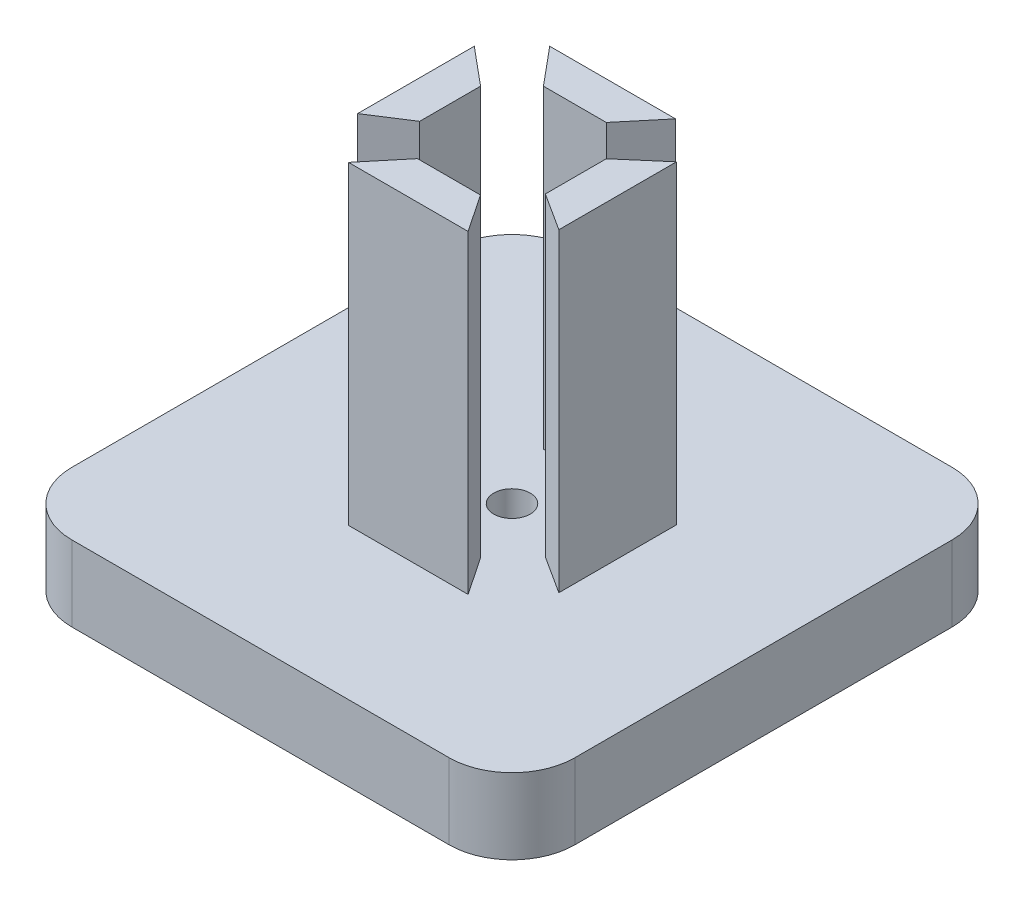
ISO-10303-21;
HEADER;
FILE_DESCRIPTION(('STEP AP214'),'2;1');
FILE_NAME('part.step','',(''),(''),'','','');
FILE_SCHEMA(('AUTOMOTIVE_DESIGN { 1 0 10303 214 1 1 1 1 }'));
ENDSEC;
DATA;
#1=APPLICATION_CONTEXT('core data for automotive mechanical design processes');
#2=APPLICATION_PROTOCOL_DEFINITION('international standard','automotive_design',2000,#1);
#3=PRODUCT_CONTEXT('',#1,'mechanical');
#4=PRODUCT('Part','Part','',(#3));
#5=PRODUCT_RELATED_PRODUCT_CATEGORY('part','',(#4));
#6=PRODUCT_DEFINITION_FORMATION('','',#4);
#7=PRODUCT_DEFINITION_CONTEXT('part definition',#1,'design');
#8=PRODUCT_DEFINITION('design','',#6,#7);
#9=PRODUCT_DEFINITION_SHAPE('','',#8);
#10=(LENGTH_UNIT() NAMED_UNIT(*) SI_UNIT(.MILLI.,.METRE.));
#11=(NAMED_UNIT(*) PLANE_ANGLE_UNIT() SI_UNIT($,.RADIAN.));
#12=(NAMED_UNIT(*) SI_UNIT($,.STERADIAN.) SOLID_ANGLE_UNIT());
#13=UNCERTAINTY_MEASURE_WITH_UNIT(LENGTH_MEASURE(1.E-05),#10,'distance_accuracy_value','');
#14=(GEOMETRIC_REPRESENTATION_CONTEXT(3) GLOBAL_UNCERTAINTY_ASSIGNED_CONTEXT((#13)) GLOBAL_UNIT_ASSIGNED_CONTEXT((#10,
#11,#12)) REPRESENTATION_CONTEXT('',''));
#15=CARTESIAN_POINT('',(0.,0.,0.));
#16=DIRECTION('',(0.,0.,1.));
#17=DIRECTION('',(1.,0.,0.));
#18=AXIS2_PLACEMENT_3D('',#15,#16,#17);
#19=CARTESIAN_POINT('',(0.,6.,0.));
#20=DIRECTION('',(0.,1.,0.));
#21=DIRECTION('',(0.,0.,1.));
#22=AXIS2_PLACEMENT_3D('',#19,#20,#21);
#23=PLANE('',#22);
#24=CARTESIAN_POINT('',(0.,6.,0.));
#25=DIRECTION('',(0.,1.,0.));
#26=DIRECTION('',(0.,0.,1.));
#27=AXIS2_PLACEMENT_3D('',#24,#25,#26);
#28=CIRCLE('',#27,1.45);
#29=CARTESIAN_POINT('',(0.,6.,1.45));
#30=VERTEX_POINT('',#29);
#31=EDGE_CURVE('E625',#30,#30,#28,.T.);
#32=ORIENTED_EDGE('',*,*,#31,.F.);
#33=EDGE_LOOP('',(#32));
#34=FACE_BOUND('',#33,.T.);
#35=DIRECTION('',(0.,0.,1.));
#36=VECTOR('',#35,1.);
#37=CARTESIAN_POINT('',(-20.,6.,20.));
#38=LINE('',#37,#36);
#39=CARTESIAN_POINT('',(-20.,6.,-15.));
#40=VERTEX_POINT('',#39);
#41=CARTESIAN_POINT('',(-20.,6.,15.));
#42=VERTEX_POINT('',#41);
#43=EDGE_CURVE('E362',#40,#42,#38,.T.);
#44=ORIENTED_EDGE('',*,*,#43,.T.);
#45=CARTESIAN_POINT('',(-15.,6.,15.));
#46=DIRECTION('',(0.,1.,0.));
#47=DIRECTION('',(0.,0.,1.));
#48=AXIS2_PLACEMENT_3D('',#45,#46,#47);
#49=CIRCLE('',#48,5.);
#50=CARTESIAN_POINT('',(-15.,6.,20.));
#51=VERTEX_POINT('',#50);
#52=EDGE_CURVE('E424',#42,#51,#49,.T.);
#53=ORIENTED_EDGE('',*,*,#52,.T.);
#54=DIRECTION('',(1.,0.,0.));
#55=VECTOR('',#54,1.);
#56=CARTESIAN_POINT('',(20.,6.,20.));
#57=LINE('',#56,#55);
#58=CARTESIAN_POINT('',(15.,6.,20.));
#59=VERTEX_POINT('',#58);
#60=EDGE_CURVE('E366',#51,#59,#57,.T.);
#61=ORIENTED_EDGE('',*,*,#60,.T.);
#62=CARTESIAN_POINT('',(15.,6.,15.));
#63=DIRECTION('',(0.,1.,0.));
#64=DIRECTION('',(0.,0.,1.));
#65=AXIS2_PLACEMENT_3D('',#62,#63,#64);
#66=CIRCLE('',#65,5.);
#67=CARTESIAN_POINT('',(20.,6.,15.));
#68=VERTEX_POINT('',#67);
#69=EDGE_CURVE('E418',#59,#68,#66,.T.);
#70=ORIENTED_EDGE('',*,*,#69,.T.);
#71=DIRECTION('',(0.,0.,-1.));
#72=VECTOR('',#71,1.);
#73=CARTESIAN_POINT('',(20.,6.,20.));
#74=LINE('',#73,#72);
#75=CARTESIAN_POINT('',(20.,6.,-15.));
#76=VERTEX_POINT('',#75);
#77=EDGE_CURVE('E371',#68,#76,#74,.T.);
#78=ORIENTED_EDGE('',*,*,#77,.T.);
#79=CARTESIAN_POINT('',(15.,6.,-15.));
#80=DIRECTION('',(0.,1.,0.));
#81=DIRECTION('',(0.,0.,1.));
#82=AXIS2_PLACEMENT_3D('',#79,#80,#81);
#83=CIRCLE('',#82,5.);
#84=CARTESIAN_POINT('',(15.,6.,-20.));
#85=VERTEX_POINT('',#84);
#86=EDGE_CURVE('E63',#76,#85,#83,.T.);
#87=ORIENTED_EDGE('',*,*,#86,.T.);
#88=DIRECTION('',(-1.,0.,0.));
#89=VECTOR('',#88,1.);
#90=CARTESIAN_POINT('',(20.,6.,-20.));
#91=LINE('',#90,#89);
#92=CARTESIAN_POINT('',(-15.,6.,-20.));
#93=VERTEX_POINT('',#92);
#94=EDGE_CURVE('E374',#85,#93,#91,.T.);
#95=ORIENTED_EDGE('',*,*,#94,.T.);
#96=CARTESIAN_POINT('',(-15.,6.,-15.));
#97=DIRECTION('',(0.,1.,0.));
#98=DIRECTION('',(0.,0.,1.));
#99=AXIS2_PLACEMENT_3D('',#96,#97,#98);
#100=CIRCLE('',#99,5.);
#101=EDGE_CURVE('E421',#93,#40,#100,.T.);
#102=ORIENTED_EDGE('',*,*,#101,.T.);
#103=EDGE_LOOP('',(#44,#53,#61,#70,#78,#87,#95,#102));
#104=FACE_BOUND('',#103,.T.);
#105=DIRECTION('',(1.,0.,0.));
#106=VECTOR('',#105,1.);
#107=CARTESIAN_POINT('',(-2.5,6.,-5.));
#108=LINE('',#107,#106);
#109=CARTESIAN_POINT('',(-2.5,6.,-5.));
#110=VERTEX_POINT('',#109);
#111=CARTESIAN_POINT('',(2.5,6.,-5.));
#112=VERTEX_POINT('',#111);
#113=EDGE_CURVE('E339',#110,#112,#108,.T.);
#114=ORIENTED_EDGE('',*,*,#113,.F.);
#115=DIRECTION('',(0.64018439966448,0.,0.768221279597376));
#116=VECTOR('',#115,1.);
#117=CARTESIAN_POINT('',(-5.,6.,-8.));
#118=LINE('',#117,#116);
#119=CARTESIAN_POINT('',(-5.,6.,-8.));
#120=VERTEX_POINT('',#119);
#121=EDGE_CURVE('E320',#120,#110,#118,.T.);
#122=ORIENTED_EDGE('',*,*,#121,.F.);
#123=DIRECTION('',(-1.,0.,0.));
#124=VECTOR('',#123,1.);
#125=CARTESIAN_POINT('',(5.,6.,-8.));
#126=LINE('',#125,#124);
#127=CARTESIAN_POINT('',(5.,6.,-8.));
#128=VERTEX_POINT('',#127);
#129=EDGE_CURVE('E326',#128,#120,#126,.T.);
#130=ORIENTED_EDGE('',*,*,#129,.F.);
#131=DIRECTION('',(0.64018439966448,0.,-0.768221279597376));
#132=VECTOR('',#131,1.);
#133=CARTESIAN_POINT('',(2.5,6.,-5.));
#134=LINE('',#133,#132);
#135=EDGE_CURVE('E342',#112,#128,#134,.T.);
#136=ORIENTED_EDGE('',*,*,#135,.F.);
#137=EDGE_LOOP('',(#114,#122,#130,#136));
#138=FACE_BOUND('',#137,.T.);
#139=DIRECTION('',(-1.,0.,0.));
#140=VECTOR('',#139,1.);
#141=CARTESIAN_POINT('',(2.48470976691695,6.,5.00000000000001));
#142=LINE('',#141,#140);
#143=CARTESIAN_POINT('',(2.48470976691695,6.,5.00000000000001));
#144=VERTEX_POINT('',#143);
#145=CARTESIAN_POINT('',(-2.51529023308305,6.,5.00000000000001));
#146=VERTEX_POINT('',#145);
#147=EDGE_CURVE('E298',#144,#146,#142,.T.);
#148=ORIENTED_EDGE('',*,*,#147,.F.);
#149=DIRECTION('',(-0.560322304969748,0.,-0.828274661301062));
#150=VECTOR('',#149,1.);
#151=CARTESIAN_POINT('',(4.51418983367254,6.,8.00000000000001));
#152=LINE('',#151,#150);
#153=CARTESIAN_POINT('',(4.51418983367254,6.,8.00000000000001));
#154=VERTEX_POINT('',#153);
#155=EDGE_CURVE('E279',#154,#144,#152,.T.);
#156=ORIENTED_EDGE('',*,*,#155,.F.);
#157=DIRECTION('',(1.,0.,0.));
#158=VECTOR('',#157,1.);
#159=CARTESIAN_POINT('',(-5.,6.,8.00000000000001));
#160=LINE('',#159,#158);
#161=CARTESIAN_POINT('',(-5.,6.,8.00000000000001));
#162=VERTEX_POINT('',#161);
#163=EDGE_CURVE('E285',#162,#154,#160,.T.);
#164=ORIENTED_EDGE('',*,*,#163,.F.);
#165=DIRECTION('',(-0.63786494885351,0.,0.770148237045382));
#166=VECTOR('',#165,1.);
#167=CARTESIAN_POINT('',(-2.51529023308305,6.,5.00000000000001));
#168=LINE('',#167,#166);
#169=EDGE_CURVE('E301',#146,#162,#168,.T.);
#170=ORIENTED_EDGE('',*,*,#169,.F.);
#171=EDGE_LOOP('',(#148,#156,#164,#170));
#172=FACE_BOUND('',#171,.T.);
#173=DIRECTION('',(0.,0.,1.));
#174=VECTOR('',#173,1.);
#175=CARTESIAN_POINT('',(4.99999999999999,6.,-2.5));
#176=LINE('',#175,#174);
#177=CARTESIAN_POINT('',(4.99999999999999,6.,-2.5));
#178=VERTEX_POINT('',#177);
#179=CARTESIAN_POINT('',(4.99999999999999,6.,2.34718490309922));
#180=VERTEX_POINT('',#179);
#181=EDGE_CURVE('E237',#178,#180,#176,.T.);
#182=ORIENTED_EDGE('',*,*,#181,.F.);
#183=DIRECTION('',(-0.758634124776321,0.,0.651516895195256));
#184=VECTOR('',#183,1.);
#185=CARTESIAN_POINT('',(7.99999999999999,6.,-5.07640754845039));
#186=LINE('',#185,#184);
#187=CARTESIAN_POINT('',(7.99999999999999,6.,-5.07640754845039));
#188=VERTEX_POINT('',#187);
#189=EDGE_CURVE('E232',#188,#178,#186,.T.);
#190=ORIENTED_EDGE('',*,*,#189,.F.);
#191=DIRECTION('',(0.,0.,-1.));
#192=VECTOR('',#191,1.);
#193=CARTESIAN_POINT('',(7.99999999999999,6.,4.27522964493053));
#194=LINE('',#193,#192);
#195=CARTESIAN_POINT('',(7.99999999999999,6.,4.27522964493053));
#196=VERTEX_POINT('',#195);
#197=EDGE_CURVE('E248',#196,#188,#194,.T.);
#198=ORIENTED_EDGE('',*,*,#197,.F.);
#199=DIRECTION('',(0.841245649617985,0.,0.540653083778142));
#200=VECTOR('',#199,1.);
#201=CARTESIAN_POINT('',(4.99999999999999,6.,2.34718490309922));
#202=LINE('',#201,#200);
#203=EDGE_CURVE('E260',#180,#196,#202,.T.);
#204=ORIENTED_EDGE('',*,*,#203,.F.);
#205=EDGE_LOOP('',(#182,#190,#198,#204));
#206=FACE_BOUND('',#205,.T.);
#207=DIRECTION('',(0.,0.,1.));
#208=VECTOR('',#207,1.);
#209=CARTESIAN_POINT('',(-8.00000000000001,6.,4.27522964493053));
#210=LINE('',#209,#208);
#211=CARTESIAN_POINT('',(-8.00000000000001,6.,-5.));
#212=VERTEX_POINT('',#211);
#213=CARTESIAN_POINT('',(-8.00000000000001,6.,4.27522964493053));
#214=VERTEX_POINT('',#213);
#215=EDGE_CURVE('E599',#212,#214,#210,.T.);
#216=ORIENTED_EDGE('',*,*,#215,.F.);
#217=DIRECTION('',(-0.768221279597376,0.,-0.64018439966448));
#218=VECTOR('',#217,1.);
#219=CARTESIAN_POINT('',(-8.00000000000001,6.,-5.));
#220=LINE('',#219,#218);
#221=CARTESIAN_POINT('',(-5.00000000000001,6.,-2.5));
#222=VERTEX_POINT('',#221);
#223=EDGE_CURVE('E229',#222,#212,#220,.T.);
#224=ORIENTED_EDGE('',*,*,#223,.F.);
#225=DIRECTION('',(0.,0.,-1.));
#226=VECTOR('',#225,1.);
#227=CARTESIAN_POINT('',(-5.00000000000001,6.,-2.5));
#228=LINE('',#227,#226);
#229=CARTESIAN_POINT('',(-5.00000000000001,6.,2.34718490309922));
#230=VERTEX_POINT('',#229);
#231=EDGE_CURVE('E225',#230,#222,#228,.T.);
#232=ORIENTED_EDGE('',*,*,#231,.F.);
#233=DIRECTION('',(0.841245649617985,0.,-0.540653083778141));
#234=VECTOR('',#233,1.);
#235=CARTESIAN_POINT('',(-5.00000000000001,6.,2.34718490309922));
#236=LINE('',#235,#234);
#237=EDGE_CURVE('E602',#214,#230,#236,.T.);
#238=ORIENTED_EDGE('',*,*,#237,.F.);
#239=EDGE_LOOP('',(#216,#224,#232,#238));
#240=FACE_BOUND('',#239,.T.);
#241=ADVANCED_FACE('F40',(#34,#104,#138,#172,#206,#240),#23,.T.);
#242=CARTESIAN_POINT('',(-20.,6.,20.));
#243=DIRECTION('',(1.,0.,0.));
#244=DIRECTION('',(0.,0.,-1.));
#245=AXIS2_PLACEMENT_3D('',#242,#243,#244);
#246=PLANE('',#245);
#247=DIRECTION('',(0.,0.,1.));
#248=VECTOR('',#247,1.);
#249=CARTESIAN_POINT('',(-20.,0.,20.));
#250=LINE('',#249,#248);
#251=CARTESIAN_POINT('',(-20.,0.,-15.));
#252=VERTEX_POINT('',#251);
#253=CARTESIAN_POINT('',(-20.,0.,15.));
#254=VERTEX_POINT('',#253);
#255=EDGE_CURVE('E361',#252,#254,#250,.T.);
#256=ORIENTED_EDGE('',*,*,#255,.T.);
#257=DIRECTION('',(0.,-1.,0.));
#258=VECTOR('',#257,1.);
#259=CARTESIAN_POINT('',(-20.,6.,15.));
#260=LINE('',#259,#258);
#261=EDGE_CURVE('E413',#254,#42,#260,.F.);
#262=ORIENTED_EDGE('',*,*,#261,.T.);
#263=ORIENTED_EDGE('',*,*,#43,.F.);
#264=DIRECTION('',(0.,-1.,0.));
#265=VECTOR('',#264,1.);
#266=CARTESIAN_POINT('',(-20.,6.,-15.));
#267=LINE('',#266,#265);
#268=EDGE_CURVE('E409',#40,#252,#267,.T.);
#269=ORIENTED_EDGE('',*,*,#268,.T.);
#270=EDGE_LOOP('',(#256,#262,#263,#269));
#271=FACE_BOUND('',#270,.T.);
#272=ADVANCED_FACE('F455',(#271),#246,.F.);
#273=CARTESIAN_POINT('',(20.,6.,20.));
#274=DIRECTION('',(0.,0.,-1.));
#275=DIRECTION('',(-1.,0.,0.));
#276=AXIS2_PLACEMENT_3D('',#273,#274,#275);
#277=PLANE('',#276);
#278=ORIENTED_EDGE('',*,*,#60,.F.);
#279=DIRECTION('',(0.,-1.,0.));
#280=VECTOR('',#279,1.);
#281=CARTESIAN_POINT('',(-15.,6.,20.));
#282=LINE('',#281,#280);
#283=CARTESIAN_POINT('',(-15.,0.,20.));
#284=VERTEX_POINT('',#283);
#285=EDGE_CURVE('E393',#51,#284,#282,.T.);
#286=ORIENTED_EDGE('',*,*,#285,.T.);
#287=DIRECTION('',(1.,0.,0.));
#288=VECTOR('',#287,1.);
#289=CARTESIAN_POINT('',(20.,0.,20.));
#290=LINE('',#289,#288);
#291=CARTESIAN_POINT('',(15.,0.,20.));
#292=VERTEX_POINT('',#291);
#293=EDGE_CURVE('E381',#284,#292,#290,.T.);
#294=ORIENTED_EDGE('',*,*,#293,.T.);
#295=DIRECTION('',(0.,-1.,0.));
#296=VECTOR('',#295,1.);
#297=CARTESIAN_POINT('',(15.,6.,20.));
#298=LINE('',#297,#296);
#299=EDGE_CURVE('E377',#292,#59,#298,.F.);
#300=ORIENTED_EDGE('',*,*,#299,.T.);
#301=EDGE_LOOP('',(#278,#286,#294,#300));
#302=FACE_BOUND('',#301,.T.);
#303=ADVANCED_FACE('F463',(#302),#277,.F.);
#304=CARTESIAN_POINT('',(20.,6.,20.));
#305=DIRECTION('',(-1.,0.,0.));
#306=DIRECTION('',(0.,0.,1.));
#307=AXIS2_PLACEMENT_3D('',#304,#305,#306);
#308=PLANE('',#307);
#309=ORIENTED_EDGE('',*,*,#77,.F.);
#310=DIRECTION('',(0.,-1.,0.));
#311=VECTOR('',#310,1.);
#312=CARTESIAN_POINT('',(20.,6.,15.));
#313=LINE('',#312,#311);
#314=CARTESIAN_POINT('',(20.,0.,15.));
#315=VERTEX_POINT('',#314);
#316=EDGE_CURVE('E11',#68,#315,#313,.T.);
#317=ORIENTED_EDGE('',*,*,#316,.T.);
#318=DIRECTION('',(0.,0.,-1.));
#319=VECTOR('',#318,1.);
#320=CARTESIAN_POINT('',(20.,0.,20.));
#321=LINE('',#320,#319);
#322=CARTESIAN_POINT('',(20.,0.,-15.));
#323=VERTEX_POINT('',#322);
#324=EDGE_CURVE('E385',#315,#323,#321,.T.);
#325=ORIENTED_EDGE('',*,*,#324,.T.);
#326=DIRECTION('',(0.,-1.,0.));
#327=VECTOR('',#326,1.);
#328=CARTESIAN_POINT('',(20.,6.,-15.));
#329=LINE('',#328,#327);
#330=EDGE_CURVE('E49',#323,#76,#329,.F.);
#331=ORIENTED_EDGE('',*,*,#330,.T.);
#332=EDGE_LOOP('',(#309,#317,#325,#331));
#333=FACE_BOUND('',#332,.T.);
#334=ADVANCED_FACE('F436',(#333),#308,.F.);
#335=CARTESIAN_POINT('',(20.,6.,-20.));
#336=DIRECTION('',(0.,0.,1.));
#337=DIRECTION('',(1.,0.,0.));
#338=AXIS2_PLACEMENT_3D('',#335,#336,#337);
#339=PLANE('',#338);
#340=DIRECTION('',(-1.,0.,0.));
#341=VECTOR('',#340,1.);
#342=CARTESIAN_POINT('',(20.,0.,-20.));
#343=LINE('',#342,#341);
#344=CARTESIAN_POINT('',(15.,0.,-20.));
#345=VERTEX_POINT('',#344);
#346=CARTESIAN_POINT('',(-15.,0.,-20.));
#347=VERTEX_POINT('',#346);
#348=EDGE_CURVE('E367',#345,#347,#343,.T.);
#349=ORIENTED_EDGE('',*,*,#348,.T.);
#350=DIRECTION('',(0.,-1.,0.));
#351=VECTOR('',#350,1.);
#352=CARTESIAN_POINT('',(-15.,6.,-20.));
#353=LINE('',#352,#351);
#354=EDGE_CURVE('E56',#347,#93,#353,.F.);
#355=ORIENTED_EDGE('',*,*,#354,.T.);
#356=ORIENTED_EDGE('',*,*,#94,.F.);
#357=DIRECTION('',(0.,-1.,0.));
#358=VECTOR('',#357,1.);
#359=CARTESIAN_POINT('',(15.,6.,-20.));
#360=LINE('',#359,#358);
#361=EDGE_CURVE('E427',#85,#345,#360,.T.);
#362=ORIENTED_EDGE('',*,*,#361,.T.);
#363=EDGE_LOOP('',(#349,#355,#356,#362));
#364=FACE_BOUND('',#363,.T.);
#365=ADVANCED_FACE('F444',(#364),#339,.F.);
#366=CARTESIAN_POINT('',(0.,0.,0.));
#367=DIRECTION('',(0.,1.,0.));
#368=DIRECTION('',(0.,0.,1.));
#369=AXIS2_PLACEMENT_3D('',#366,#367,#368);
#370=PLANE('',#369);
#371=CARTESIAN_POINT('',(0.,0.,0.));
#372=DIRECTION('',(0.,1.,0.));
#373=DIRECTION('',(0.,0.,1.));
#374=AXIS2_PLACEMENT_3D('',#371,#372,#373);
#375=CIRCLE('',#374,1.45);
#376=CARTESIAN_POINT('',(0.,0.,1.45));
#377=VERTEX_POINT('',#376);
#378=EDGE_CURVE('E608',#377,#377,#375,.F.);
#379=ORIENTED_EDGE('',*,*,#378,.F.);
#380=EDGE_LOOP('',(#379));
#381=FACE_BOUND('',#380,.T.);
#382=ORIENTED_EDGE('',*,*,#293,.F.);
#383=CARTESIAN_POINT('',(-15.,0.,15.));
#384=DIRECTION('',(0.,1.,0.));
#385=DIRECTION('',(0.,0.,1.));
#386=AXIS2_PLACEMENT_3D('',#383,#384,#385);
#387=CIRCLE('',#386,5.);
#388=EDGE_CURVE('E406',#284,#254,#387,.F.);
#389=ORIENTED_EDGE('',*,*,#388,.T.);
#390=ORIENTED_EDGE('',*,*,#255,.F.);
#391=CARTESIAN_POINT('',(-15.,0.,-15.));
#392=DIRECTION('',(0.,1.,0.));
#393=DIRECTION('',(0.,0.,1.));
#394=AXIS2_PLACEMENT_3D('',#391,#392,#393);
#395=CIRCLE('',#394,5.);
#396=EDGE_CURVE('E403',#252,#347,#395,.F.);
#397=ORIENTED_EDGE('',*,*,#396,.T.);
#398=ORIENTED_EDGE('',*,*,#348,.F.);
#399=CARTESIAN_POINT('',(15.,0.,-15.));
#400=DIRECTION('',(0.,1.,0.));
#401=DIRECTION('',(0.,0.,1.));
#402=AXIS2_PLACEMENT_3D('',#399,#400,#401);
#403=CIRCLE('',#402,5.);
#404=EDGE_CURVE('E397',#345,#323,#403,.F.);
#405=ORIENTED_EDGE('',*,*,#404,.T.);
#406=ORIENTED_EDGE('',*,*,#324,.F.);
#407=CARTESIAN_POINT('',(15.,0.,15.));
#408=DIRECTION('',(0.,1.,0.));
#409=DIRECTION('',(0.,0.,1.));
#410=AXIS2_PLACEMENT_3D('',#407,#408,#409);
#411=CIRCLE('',#410,5.);
#412=EDGE_CURVE('E400',#315,#292,#411,.F.);
#413=ORIENTED_EDGE('',*,*,#412,.T.);
#414=EDGE_LOOP('',(#382,#389,#390,#397,#398,#405,#406,#413));
#415=FACE_BOUND('',#414,.T.);
#416=ADVANCED_FACE('F447',(#381,#415),#370,.F.);
#417=CARTESIAN_POINT('',(-5.,31.,-8.));
#418=DIRECTION('',(0.768221279597376,0.,-0.64018439966448));
#419=DIRECTION('',(-0.64018439966448,0.,-0.768221279597376));
#420=AXIS2_PLACEMENT_3D('',#417,#418,#419);
#421=PLANE('',#420);
#422=ORIENTED_EDGE('',*,*,#121,.T.);
#423=DIRECTION('',(0.,-1.,0.));
#424=VECTOR('',#423,1.);
#425=CARTESIAN_POINT('',(-2.5,31.,-5.));
#426=LINE('',#425,#424);
#427=CARTESIAN_POINT('',(-2.5,31.,-5.));
#428=VERTEX_POINT('',#427);
#429=EDGE_CURVE('E358',#428,#110,#426,.T.);
#430=ORIENTED_EDGE('',*,*,#429,.F.);
#431=DIRECTION('',(0.64018439966448,0.,0.768221279597376));
#432=VECTOR('',#431,1.);
#433=CARTESIAN_POINT('',(-5.,31.,-8.));
#434=LINE('',#433,#432);
#435=CARTESIAN_POINT('',(-5.,31.,-8.));
#436=VERTEX_POINT('',#435);
#437=EDGE_CURVE('E321',#436,#428,#434,.T.);
#438=ORIENTED_EDGE('',*,*,#437,.F.);
#439=DIRECTION('',(0.,-1.,0.));
#440=VECTOR('',#439,1.);
#441=CARTESIAN_POINT('',(-5.,31.,-8.));
#442=LINE('',#441,#440);
#443=EDGE_CURVE('E335',#436,#120,#442,.T.);
#444=ORIENTED_EDGE('',*,*,#443,.T.);
#445=EDGE_LOOP('',(#422,#430,#438,#444));
#446=FACE_BOUND('',#445,.T.);
#447=ADVANCED_FACE('F483',(#446),#421,.F.);
#448=CARTESIAN_POINT('',(-2.5,31.,-5.));
#449=DIRECTION('',(0.,0.,-1.));
#450=DIRECTION('',(-1.,0.,0.));
#451=AXIS2_PLACEMENT_3D('',#448,#449,#450);
#452=PLANE('',#451);
#453=ORIENTED_EDGE('',*,*,#113,.T.);
#454=DIRECTION('',(0.,-1.,0.));
#455=VECTOR('',#454,1.);
#456=CARTESIAN_POINT('',(2.5,31.,-5.));
#457=LINE('',#456,#455);
#458=CARTESIAN_POINT('',(2.5,31.,-5.));
#459=VERTEX_POINT('',#458);
#460=EDGE_CURVE('E354',#459,#112,#457,.T.);
#461=ORIENTED_EDGE('',*,*,#460,.F.);
#462=DIRECTION('',(1.,0.,0.));
#463=VECTOR('',#462,1.);
#464=CARTESIAN_POINT('',(-2.5,31.,-5.));
#465=LINE('',#464,#463);
#466=EDGE_CURVE('E325',#428,#459,#465,.T.);
#467=ORIENTED_EDGE('',*,*,#466,.F.);
#468=ORIENTED_EDGE('',*,*,#429,.T.);
#469=EDGE_LOOP('',(#453,#461,#467,#468));
#470=FACE_BOUND('',#469,.T.);
#471=ADVANCED_FACE('F570',(#470),#452,.F.);
#472=CARTESIAN_POINT('',(2.5,31.,-5.));
#473=DIRECTION('',(-0.768221279597376,0.,-0.64018439966448));
#474=DIRECTION('',(-0.64018439966448,0.,0.768221279597376));
#475=AXIS2_PLACEMENT_3D('',#472,#473,#474);
#476=PLANE('',#475);
#477=ORIENTED_EDGE('',*,*,#135,.T.);
#478=DIRECTION('',(0.,-1.,0.));
#479=VECTOR('',#478,1.);
#480=CARTESIAN_POINT('',(5.,31.,-8.));
#481=LINE('',#480,#479);
#482=CARTESIAN_POINT('',(5.,31.,-8.));
#483=VERTEX_POINT('',#482);
#484=EDGE_CURVE('E351',#483,#128,#481,.T.);
#485=ORIENTED_EDGE('',*,*,#484,.F.);
#486=DIRECTION('',(0.64018439966448,0.,-0.768221279597376));
#487=VECTOR('',#486,1.);
#488=CARTESIAN_POINT('',(2.5,31.,-5.));
#489=LINE('',#488,#487);
#490=EDGE_CURVE('E329',#459,#483,#489,.T.);
#491=ORIENTED_EDGE('',*,*,#490,.F.);
#492=ORIENTED_EDGE('',*,*,#460,.T.);
#493=EDGE_LOOP('',(#477,#485,#491,#492));
#494=FACE_BOUND('',#493,.T.);
#495=ADVANCED_FACE('F567',(#494),#476,.F.);
#496=CARTESIAN_POINT('',(5.,31.,-8.));
#497=DIRECTION('',(0.,0.,1.));
#498=DIRECTION('',(1.,0.,0.));
#499=AXIS2_PLACEMENT_3D('',#496,#497,#498);
#500=PLANE('',#499);
#501=ORIENTED_EDGE('',*,*,#129,.T.);
#502=ORIENTED_EDGE('',*,*,#443,.F.);
#503=DIRECTION('',(-1.,0.,0.));
#504=VECTOR('',#503,1.);
#505=CARTESIAN_POINT('',(5.,31.,-8.));
#506=LINE('',#505,#504);
#507=EDGE_CURVE('E332',#483,#436,#506,.T.);
#508=ORIENTED_EDGE('',*,*,#507,.F.);
#509=ORIENTED_EDGE('',*,*,#484,.T.);
#510=EDGE_LOOP('',(#501,#502,#508,#509));
#511=FACE_BOUND('',#510,.T.);
#512=ADVANCED_FACE('F563',(#511),#500,.F.);
#513=CARTESIAN_POINT('',(0.,31.,0.));
#514=DIRECTION('',(0.,1.,0.));
#515=DIRECTION('',(0.,0.,1.));
#516=AXIS2_PLACEMENT_3D('',#513,#514,#515);
#517=PLANE('',#516);
#518=ORIENTED_EDGE('',*,*,#437,.T.);
#519=ORIENTED_EDGE('',*,*,#466,.T.);
#520=ORIENTED_EDGE('',*,*,#490,.T.);
#521=ORIENTED_EDGE('',*,*,#507,.T.);
#522=EDGE_LOOP('',(#518,#519,#520,#521));
#523=FACE_BOUND('',#522,.T.);
#524=ADVANCED_FACE('F559',(#523),#517,.T.);
#525=CARTESIAN_POINT('',(4.51418983367254,31.,8.00000000000001));
#526=DIRECTION('',(-0.828274661301062,0.,0.560322304969748));
#527=DIRECTION('',(0.560322304969748,0.,0.828274661301062));
#528=AXIS2_PLACEMENT_3D('',#525,#526,#527);
#529=PLANE('',#528);
#530=ORIENTED_EDGE('',*,*,#155,.T.);
#531=DIRECTION('',(0.,-1.,0.));
#532=VECTOR('',#531,1.);
#533=CARTESIAN_POINT('',(2.48470976691695,31.,5.00000000000001));
#534=LINE('',#533,#532);
#535=CARTESIAN_POINT('',(2.48470976691695,31.,5.00000000000001));
#536=VERTEX_POINT('',#535);
#537=EDGE_CURVE('E317',#536,#144,#534,.T.);
#538=ORIENTED_EDGE('',*,*,#537,.F.);
#539=DIRECTION('',(-0.560322304969748,0.,-0.828274661301062));
#540=VECTOR('',#539,1.);
#541=CARTESIAN_POINT('',(4.51418983367254,31.,8.00000000000001));
#542=LINE('',#541,#540);
#543=CARTESIAN_POINT('',(4.51418983367254,31.,8.00000000000001));
#544=VERTEX_POINT('',#543);
#545=EDGE_CURVE('E280',#544,#536,#542,.T.);
#546=ORIENTED_EDGE('',*,*,#545,.F.);
#547=DIRECTION('',(0.,-1.,0.));
#548=VECTOR('',#547,1.);
#549=CARTESIAN_POINT('',(4.51418983367254,31.,8.00000000000001));
#550=LINE('',#549,#548);
#551=EDGE_CURVE('E294',#544,#154,#550,.T.);
#552=ORIENTED_EDGE('',*,*,#551,.T.);
#553=EDGE_LOOP('',(#530,#538,#546,#552));
#554=FACE_BOUND('',#553,.T.);
#555=ADVANCED_FACE('F555',(#554),#529,.F.);
#556=CARTESIAN_POINT('',(2.48470976691695,31.,5.00000000000001));
#557=DIRECTION('',(0.,0.,1.));
#558=DIRECTION('',(1.,0.,0.));
#559=AXIS2_PLACEMENT_3D('',#556,#557,#558);
#560=PLANE('',#559);
#561=ORIENTED_EDGE('',*,*,#147,.T.);
#562=DIRECTION('',(0.,-1.,0.));
#563=VECTOR('',#562,1.);
#564=CARTESIAN_POINT('',(-2.51529023308305,31.,5.00000000000001));
#565=LINE('',#564,#563);
#566=CARTESIAN_POINT('',(-2.51529023308305,31.,5.00000000000001));
#567=VERTEX_POINT('',#566);
#568=EDGE_CURVE('E313',#567,#146,#565,.T.);
#569=ORIENTED_EDGE('',*,*,#568,.F.);
#570=DIRECTION('',(-1.,0.,0.));
#571=VECTOR('',#570,1.);
#572=CARTESIAN_POINT('',(2.48470976691695,31.,5.00000000000001));
#573=LINE('',#572,#571);
#574=EDGE_CURVE('E284',#536,#567,#573,.T.);
#575=ORIENTED_EDGE('',*,*,#574,.F.);
#576=ORIENTED_EDGE('',*,*,#537,.T.);
#577=EDGE_LOOP('',(#561,#569,#575,#576));
#578=FACE_BOUND('',#577,.T.);
#579=ADVANCED_FACE('F551',(#578),#560,.F.);
#580=CARTESIAN_POINT('',(-2.51529023308305,31.,5.00000000000001));
#581=DIRECTION('',(0.770148237045382,0.,0.63786494885351));
#582=DIRECTION('',(0.63786494885351,0.,-0.770148237045382));
#583=AXIS2_PLACEMENT_3D('',#580,#581,#582);
#584=PLANE('',#583);
#585=ORIENTED_EDGE('',*,*,#169,.T.);
#586=DIRECTION('',(0.,-1.,0.));
#587=VECTOR('',#586,1.);
#588=CARTESIAN_POINT('',(-5.,31.,8.00000000000001));
#589=LINE('',#588,#587);
#590=CARTESIAN_POINT('',(-5.,31.,8.00000000000001));
#591=VERTEX_POINT('',#590);
#592=EDGE_CURVE('E310',#591,#162,#589,.T.);
#593=ORIENTED_EDGE('',*,*,#592,.F.);
#594=DIRECTION('',(-0.63786494885351,0.,0.770148237045382));
#595=VECTOR('',#594,1.);
#596=CARTESIAN_POINT('',(-2.51529023308305,31.,5.00000000000001));
#597=LINE('',#596,#595);
#598=EDGE_CURVE('E288',#567,#591,#597,.T.);
#599=ORIENTED_EDGE('',*,*,#598,.F.);
#600=ORIENTED_EDGE('',*,*,#568,.T.);
#601=EDGE_LOOP('',(#585,#593,#599,#600));
#602=FACE_BOUND('',#601,.T.);
#603=ADVANCED_FACE('F547',(#602),#584,.F.);
#604=CARTESIAN_POINT('',(-5.,31.,8.00000000000001));
#605=DIRECTION('',(0.,0.,-1.));
#606=DIRECTION('',(-1.,0.,0.));
#607=AXIS2_PLACEMENT_3D('',#604,#605,#606);
#608=PLANE('',#607);
#609=ORIENTED_EDGE('',*,*,#163,.T.);
#610=ORIENTED_EDGE('',*,*,#551,.F.);
#611=DIRECTION('',(1.,0.,0.));
#612=VECTOR('',#611,1.);
#613=CARTESIAN_POINT('',(-5.,31.,8.00000000000001));
#614=LINE('',#613,#612);
#615=EDGE_CURVE('E291',#591,#544,#614,.T.);
#616=ORIENTED_EDGE('',*,*,#615,.F.);
#617=ORIENTED_EDGE('',*,*,#592,.T.);
#618=EDGE_LOOP('',(#609,#610,#616,#617));
#619=FACE_BOUND('',#618,.T.);
#620=ADVANCED_FACE('F543',(#619),#608,.F.);
#621=CARTESIAN_POINT('',(0.,31.,0.));
#622=DIRECTION('',(0.,1.,0.));
#623=DIRECTION('',(0.,0.,1.));
#624=AXIS2_PLACEMENT_3D('',#621,#622,#623);
#625=PLANE('',#624);
#626=ORIENTED_EDGE('',*,*,#545,.T.);
#627=ORIENTED_EDGE('',*,*,#574,.T.);
#628=ORIENTED_EDGE('',*,*,#598,.T.);
#629=ORIENTED_EDGE('',*,*,#615,.T.);
#630=EDGE_LOOP('',(#626,#627,#628,#629));
#631=FACE_BOUND('',#630,.T.);
#632=ADVANCED_FACE('F539',(#631),#625,.T.);
#633=CARTESIAN_POINT('',(7.99999999999999,31.,-5.07640754845039));
#634=DIRECTION('',(0.651516895195256,0.,0.758634124776321));
#635=DIRECTION('',(0.758634124776321,0.,-0.651516895195256));
#636=AXIS2_PLACEMENT_3D('',#633,#634,#635);
#637=PLANE('',#636);
#638=ORIENTED_EDGE('',*,*,#189,.T.);
#639=DIRECTION('',(0.,-1.,0.));
#640=VECTOR('',#639,1.);
#641=CARTESIAN_POINT('',(4.99999999999999,31.,-2.5));
#642=LINE('',#641,#640);
#643=CARTESIAN_POINT('',(4.99999999999999,31.,-2.5));
#644=VERTEX_POINT('',#643);
#645=EDGE_CURVE('E276',#644,#178,#642,.T.);
#646=ORIENTED_EDGE('',*,*,#645,.F.);
#647=DIRECTION('',(-0.758634124776321,0.,0.651516895195256));
#648=VECTOR('',#647,1.);
#649=CARTESIAN_POINT('',(7.99999999999999,31.,-5.07640754845039));
#650=LINE('',#649,#648);
#651=CARTESIAN_POINT('',(7.99999999999999,31.,-5.07640754845039));
#652=VERTEX_POINT('',#651);
#653=EDGE_CURVE('E243',#652,#644,#650,.T.);
#654=ORIENTED_EDGE('',*,*,#653,.F.);
#655=DIRECTION('',(0.,-1.,0.));
#656=VECTOR('',#655,1.);
#657=CARTESIAN_POINT('',(7.99999999999999,31.,-5.07640754845039));
#658=LINE('',#657,#656);
#659=EDGE_CURVE('E256',#652,#188,#658,.T.);
#660=ORIENTED_EDGE('',*,*,#659,.T.);
#661=EDGE_LOOP('',(#638,#646,#654,#660));
#662=FACE_BOUND('',#661,.T.);
#663=ADVANCED_FACE('F535',(#662),#637,.F.);
#664=CARTESIAN_POINT('',(4.99999999999999,31.,-2.5));
#665=DIRECTION('',(1.,0.,0.));
#666=DIRECTION('',(0.,0.,-1.));
#667=AXIS2_PLACEMENT_3D('',#664,#665,#666);
#668=PLANE('',#667);
#669=ORIENTED_EDGE('',*,*,#181,.T.);
#670=DIRECTION('',(0.,-1.,0.));
#671=VECTOR('',#670,1.);
#672=CARTESIAN_POINT('',(4.99999999999999,31.,2.34718490309922));
#673=LINE('',#672,#671);
#674=CARTESIAN_POINT('',(4.99999999999999,31.,2.34718490309922));
#675=VERTEX_POINT('',#674);
#676=EDGE_CURVE('E272',#675,#180,#673,.T.);
#677=ORIENTED_EDGE('',*,*,#676,.F.);
#678=DIRECTION('',(0.,0.,1.));
#679=VECTOR('',#678,1.);
#680=CARTESIAN_POINT('',(4.99999999999999,31.,-2.5));
#681=LINE('',#680,#679);
#682=EDGE_CURVE('E247',#644,#675,#681,.T.);
#683=ORIENTED_EDGE('',*,*,#682,.F.);
#684=ORIENTED_EDGE('',*,*,#645,.T.);
#685=EDGE_LOOP('',(#669,#677,#683,#684));
#686=FACE_BOUND('',#685,.T.);
#687=ADVANCED_FACE('F531',(#686),#668,.F.);
#688=CARTESIAN_POINT('',(4.99999999999999,31.,2.34718490309922));
#689=DIRECTION('',(0.540653083778142,0.,-0.841245649617985));
#690=DIRECTION('',(-0.841245649617985,0.,-0.540653083778142));
#691=AXIS2_PLACEMENT_3D('',#688,#689,#690);
#692=PLANE('',#691);
#693=ORIENTED_EDGE('',*,*,#203,.T.);
#694=DIRECTION('',(0.,-1.,0.));
#695=VECTOR('',#694,1.);
#696=CARTESIAN_POINT('',(7.99999999999999,31.,4.27522964493053));
#697=LINE('',#696,#695);
#698=CARTESIAN_POINT('',(7.99999999999999,31.,4.27522964493053));
#699=VERTEX_POINT('',#698);
#700=EDGE_CURVE('E269',#699,#196,#697,.T.);
#701=ORIENTED_EDGE('',*,*,#700,.F.);
#702=DIRECTION('',(0.841245649617985,0.,0.540653083778142));
#703=VECTOR('',#702,1.);
#704=CARTESIAN_POINT('',(4.99999999999999,31.,2.34718490309922));
#705=LINE('',#704,#703);
#706=EDGE_CURVE('E251',#675,#699,#705,.T.);
#707=ORIENTED_EDGE('',*,*,#706,.F.);
#708=ORIENTED_EDGE('',*,*,#676,.T.);
#709=EDGE_LOOP('',(#693,#701,#707,#708));
#710=FACE_BOUND('',#709,.T.);
#711=ADVANCED_FACE('F527',(#710),#692,.F.);
#712=CARTESIAN_POINT('',(7.99999999999999,31.,4.27522964493053));
#713=DIRECTION('',(-1.,0.,0.));
#714=DIRECTION('',(0.,0.,1.));
#715=AXIS2_PLACEMENT_3D('',#712,#713,#714);
#716=PLANE('',#715);
#717=ORIENTED_EDGE('',*,*,#197,.T.);
#718=ORIENTED_EDGE('',*,*,#659,.F.);
#719=DIRECTION('',(0.,0.,-1.));
#720=VECTOR('',#719,1.);
#721=CARTESIAN_POINT('',(7.99999999999999,31.,4.27522964493053));
#722=LINE('',#721,#720);
#723=EDGE_CURVE('E254',#699,#652,#722,.T.);
#724=ORIENTED_EDGE('',*,*,#723,.F.);
#725=ORIENTED_EDGE('',*,*,#700,.T.);
#726=EDGE_LOOP('',(#717,#718,#724,#725));
#727=FACE_BOUND('',#726,.T.);
#728=ADVANCED_FACE('F523',(#727),#716,.F.);
#729=CARTESIAN_POINT('',(0.,31.,0.));
#730=DIRECTION('',(0.,1.,0.));
#731=DIRECTION('',(0.,0.,1.));
#732=AXIS2_PLACEMENT_3D('',#729,#730,#731);
#733=PLANE('',#732);
#734=ORIENTED_EDGE('',*,*,#653,.T.);
#735=ORIENTED_EDGE('',*,*,#682,.T.);
#736=ORIENTED_EDGE('',*,*,#706,.T.);
#737=ORIENTED_EDGE('',*,*,#723,.T.);
#738=EDGE_LOOP('',(#734,#735,#736,#737));
#739=FACE_BOUND('',#738,.T.);
#740=ADVANCED_FACE('F520',(#739),#733,.T.);
#741=CARTESIAN_POINT('',(-8.00000000000001,31.,-5.));
#742=DIRECTION('',(-0.64018439966448,0.,0.768221279597376));
#743=DIRECTION('',(0.768221279597376,0.,0.64018439966448));
#744=AXIS2_PLACEMENT_3D('',#741,#742,#743);
#745=PLANE('',#744);
#746=ORIENTED_EDGE('',*,*,#223,.T.);
#747=DIRECTION('',(0.,-1.,0.));
#748=VECTOR('',#747,1.);
#749=CARTESIAN_POINT('',(-8.00000000000001,31.,-5.));
#750=LINE('',#749,#748);
#751=CARTESIAN_POINT('',(-8.00000000000001,31.,-5.));
#752=VERTEX_POINT('',#751);
#753=EDGE_CURVE('E207',#752,#212,#750,.T.);
#754=ORIENTED_EDGE('',*,*,#753,.F.);
#755=DIRECTION('',(-0.768221279597376,0.,-0.64018439966448));
#756=VECTOR('',#755,1.);
#757=CARTESIAN_POINT('',(-8.00000000000001,31.,-5.));
#758=LINE('',#757,#756);
#759=CARTESIAN_POINT('',(-5.00000000000001,31.,-2.5));
#760=VERTEX_POINT('',#759);
#761=EDGE_CURVE('E215',#760,#752,#758,.T.);
#762=ORIENTED_EDGE('',*,*,#761,.F.);
#763=DIRECTION('',(0.,-1.,0.));
#764=VECTOR('',#763,1.);
#765=CARTESIAN_POINT('',(-5.00000000000001,31.,-2.5));
#766=LINE('',#765,#764);
#767=EDGE_CURVE('E614',#760,#222,#766,.T.);
#768=ORIENTED_EDGE('',*,*,#767,.T.);
#769=EDGE_LOOP('',(#746,#754,#762,#768));
#770=FACE_BOUND('',#769,.T.);
#771=ADVANCED_FACE('F227',(#770),#745,.F.);
#772=CARTESIAN_POINT('',(-8.00000000000001,31.,4.27522964493053));
#773=DIRECTION('',(1.,0.,0.));
#774=DIRECTION('',(0.,0.,-1.));
#775=AXIS2_PLACEMENT_3D('',#772,#773,#774);
#776=PLANE('',#775);
#777=ORIENTED_EDGE('',*,*,#215,.T.);
#778=DIRECTION('',(0.,-1.,0.));
#779=VECTOR('',#778,1.);
#780=CARTESIAN_POINT('',(-8.00000000000001,31.,4.27522964493053));
#781=LINE('',#780,#779);
#782=CARTESIAN_POINT('',(-8.00000000000001,31.,4.27522964493053));
#783=VERTEX_POINT('',#782);
#784=EDGE_CURVE('E210',#783,#214,#781,.T.);
#785=ORIENTED_EDGE('',*,*,#784,.F.);
#786=DIRECTION('',(0.,0.,1.));
#787=VECTOR('',#786,1.);
#788=CARTESIAN_POINT('',(-8.00000000000001,31.,4.27522964493053));
#789=LINE('',#788,#787);
#790=EDGE_CURVE('E203',#752,#783,#789,.T.);
#791=ORIENTED_EDGE('',*,*,#790,.F.);
#792=ORIENTED_EDGE('',*,*,#753,.T.);
#793=EDGE_LOOP('',(#777,#785,#791,#792));
#794=FACE_BOUND('',#793,.T.);
#795=ADVANCED_FACE('F205',(#794),#776,.F.);
#796=CARTESIAN_POINT('',(-5.00000000000001,31.,2.34718490309922));
#797=DIRECTION('',(-0.540653083778141,0.,-0.841245649617985));
#798=DIRECTION('',(-0.841245649617985,0.,0.540653083778141));
#799=AXIS2_PLACEMENT_3D('',#796,#797,#798);
#800=PLANE('',#799);
#801=ORIENTED_EDGE('',*,*,#237,.T.);
#802=DIRECTION('',(0.,-1.,0.));
#803=VECTOR('',#802,1.);
#804=CARTESIAN_POINT('',(-5.00000000000001,31.,2.34718490309922));
#805=LINE('',#804,#803);
#806=CARTESIAN_POINT('',(-5.00000000000001,31.,2.34718490309922));
#807=VERTEX_POINT('',#806);
#808=EDGE_CURVE('E239',#807,#230,#805,.T.);
#809=ORIENTED_EDGE('',*,*,#808,.F.);
#810=DIRECTION('',(0.841245649617985,0.,-0.540653083778141));
#811=VECTOR('',#810,1.);
#812=CARTESIAN_POINT('',(-5.00000000000001,31.,2.34718490309922));
#813=LINE('',#812,#811);
#814=EDGE_CURVE('E214',#783,#807,#813,.T.);
#815=ORIENTED_EDGE('',*,*,#814,.F.);
#816=ORIENTED_EDGE('',*,*,#784,.T.);
#817=EDGE_LOOP('',(#801,#809,#815,#816));
#818=FACE_BOUND('',#817,.T.);
#819=ADVANCED_FACE('F511',(#818),#800,.F.);
#820=CARTESIAN_POINT('',(-5.00000000000001,31.,-2.5));
#821=DIRECTION('',(-1.,0.,0.));
#822=DIRECTION('',(0.,0.,1.));
#823=AXIS2_PLACEMENT_3D('',#820,#821,#822);
#824=PLANE('',#823);
#825=ORIENTED_EDGE('',*,*,#231,.T.);
#826=ORIENTED_EDGE('',*,*,#767,.F.);
#827=DIRECTION('',(0.,0.,-1.));
#828=VECTOR('',#827,1.);
#829=CARTESIAN_POINT('',(-5.00000000000001,31.,-2.5));
#830=LINE('',#829,#828);
#831=EDGE_CURVE('E220',#807,#760,#830,.T.);
#832=ORIENTED_EDGE('',*,*,#831,.F.);
#833=ORIENTED_EDGE('',*,*,#808,.T.);
#834=EDGE_LOOP('',(#825,#826,#832,#833));
#835=FACE_BOUND('',#834,.T.);
#836=ADVANCED_FACE('F504',(#835),#824,.F.);
#837=CARTESIAN_POINT('',(0.,31.,0.));
#838=DIRECTION('',(0.,-1.,0.));
#839=DIRECTION('',(0.,0.,-1.));
#840=AXIS2_PLACEMENT_3D('',#837,#838,#839);
#841=PLANE('',#840);
#842=ORIENTED_EDGE('',*,*,#761,.T.);
#843=ORIENTED_EDGE('',*,*,#790,.T.);
#844=ORIENTED_EDGE('',*,*,#814,.T.);
#845=ORIENTED_EDGE('',*,*,#831,.T.);
#846=EDGE_LOOP('',(#842,#843,#844,#845));
#847=FACE_BOUND('',#846,.T.);
#848=ADVANCED_FACE('F218',(#847),#841,.F.);
#849=CARTESIAN_POINT('',(0.,-0.00100000000000013,0.));
#850=DIRECTION('',(0.,1.,0.));
#851=DIRECTION('',(0.,0.,1.));
#852=AXIS2_PLACEMENT_3D('',#849,#850,#851);
#853=CYLINDRICAL_SURFACE('',#852,1.45);
#854=ORIENTED_EDGE('',*,*,#31,.T.);
#855=EDGE_LOOP('',(#854));
#856=FACE_BOUND('',#855,.T.);
#857=ORIENTED_EDGE('',*,*,#378,.T.);
#858=EDGE_LOOP('',(#857));
#859=FACE_BOUND('',#858,.T.);
#860=ADVANCED_FACE('F495',(#856,#859),#853,.F.);
#861=CARTESIAN_POINT('',(-15.,6.,15.));
#862=DIRECTION('',(0.,-1.,0.));
#863=DIRECTION('',(0.,0.,-1.));
#864=AXIS2_PLACEMENT_3D('',#861,#862,#863);
#865=CYLINDRICAL_SURFACE('',#864,5.);
#866=ORIENTED_EDGE('',*,*,#52,.F.);
#867=ORIENTED_EDGE('',*,*,#261,.F.);
#868=ORIENTED_EDGE('',*,*,#388,.F.);
#869=ORIENTED_EDGE('',*,*,#285,.F.);
#870=EDGE_LOOP('',(#866,#867,#868,#869));
#871=FACE_BOUND('',#870,.T.);
#872=ADVANCED_FACE('F461',(#871),#865,.T.);
#873=CARTESIAN_POINT('',(-15.,6.,-15.));
#874=DIRECTION('',(0.,-1.,0.));
#875=DIRECTION('',(0.,0.,-1.));
#876=AXIS2_PLACEMENT_3D('',#873,#874,#875);
#877=CYLINDRICAL_SURFACE('',#876,5.);
#878=ORIENTED_EDGE('',*,*,#101,.F.);
#879=ORIENTED_EDGE('',*,*,#354,.F.);
#880=ORIENTED_EDGE('',*,*,#396,.F.);
#881=ORIENTED_EDGE('',*,*,#268,.F.);
#882=EDGE_LOOP('',(#878,#879,#880,#881));
#883=FACE_BOUND('',#882,.T.);
#884=ADVANCED_FACE('F452',(#883),#877,.T.);
#885=CARTESIAN_POINT('',(15.,6.,15.));
#886=DIRECTION('',(0.,-1.,0.));
#887=DIRECTION('',(0.,0.,-1.));
#888=AXIS2_PLACEMENT_3D('',#885,#886,#887);
#889=CYLINDRICAL_SURFACE('',#888,5.);
#890=ORIENTED_EDGE('',*,*,#69,.F.);
#891=ORIENTED_EDGE('',*,*,#299,.F.);
#892=ORIENTED_EDGE('',*,*,#412,.F.);
#893=ORIENTED_EDGE('',*,*,#316,.F.);
#894=EDGE_LOOP('',(#890,#891,#892,#893));
#895=FACE_BOUND('',#894,.T.);
#896=ADVANCED_FACE('F466',(#895),#889,.T.);
#897=CARTESIAN_POINT('',(15.,6.,-15.));
#898=DIRECTION('',(0.,-1.,0.));
#899=DIRECTION('',(0.,0.,-1.));
#900=AXIS2_PLACEMENT_3D('',#897,#898,#899);
#901=CYLINDRICAL_SURFACE('',#900,5.);
#902=ORIENTED_EDGE('',*,*,#86,.F.);
#903=ORIENTED_EDGE('',*,*,#330,.F.);
#904=ORIENTED_EDGE('',*,*,#404,.F.);
#905=ORIENTED_EDGE('',*,*,#361,.F.);
#906=EDGE_LOOP('',(#902,#903,#904,#905));
#907=FACE_BOUND('',#906,.T.);
#908=ADVANCED_FACE('F42',(#907),#901,.T.);
#909=CLOSED_SHELL('',(#241,#272,#303,#334,#365,#416,#447,#471,#495,#512,#524,#555,#579,#603,
#620,#632,#663,#687,#711,#728,#740,#771,#795,#819,#836,#848,#860,#872,#884,#896,#908));
#910=MANIFOLD_SOLID_BREP('B2',#909);
#911=ADVANCED_BREP_SHAPE_REPRESENTATION('',(#18,#910),#14);
#912=SHAPE_DEFINITION_REPRESENTATION(#9,#911);
ENDSEC;
END-ISO-10303-21;
